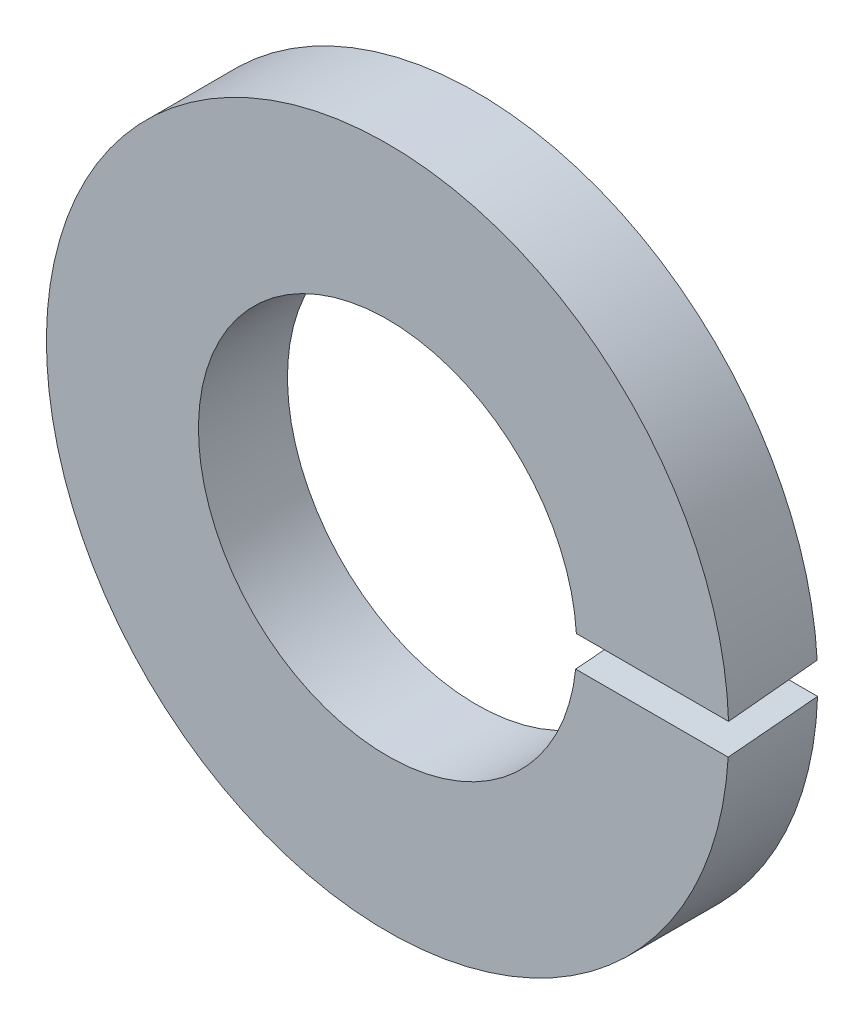
ISO-10303-21;
HEADER;
FILE_DESCRIPTION(('STEP AP214'),'2;1');
FILE_NAME('part.step','',(''),(''),'','','');
FILE_SCHEMA(('AUTOMOTIVE_DESIGN { 1 0 10303 214 1 1 1 1 }'));
ENDSEC;
DATA;
#1=APPLICATION_CONTEXT('core data for automotive mechanical design processes');
#2=APPLICATION_PROTOCOL_DEFINITION('international standard','automotive_design',2000,#1);
#3=PRODUCT_CONTEXT('',#1,'mechanical');
#4=PRODUCT('Part','Part','',(#3));
#5=PRODUCT_RELATED_PRODUCT_CATEGORY('part','',(#4));
#6=PRODUCT_DEFINITION_FORMATION('','',#4);
#7=PRODUCT_DEFINITION_CONTEXT('part definition',#1,'design');
#8=PRODUCT_DEFINITION('design','',#6,#7);
#9=PRODUCT_DEFINITION_SHAPE('','',#8);
#10=(LENGTH_UNIT() NAMED_UNIT(*) SI_UNIT(.MILLI.,.METRE.));
#11=(NAMED_UNIT(*) PLANE_ANGLE_UNIT() SI_UNIT($,.RADIAN.));
#12=(NAMED_UNIT(*) SI_UNIT($,.STERADIAN.) SOLID_ANGLE_UNIT());
#13=UNCERTAINTY_MEASURE_WITH_UNIT(LENGTH_MEASURE(1.E-05),#10,'distance_accuracy_value','');
#14=(GEOMETRIC_REPRESENTATION_CONTEXT(3) GLOBAL_UNCERTAINTY_ASSIGNED_CONTEXT((#13)) GLOBAL_UNIT_ASSIGNED_CONTEXT((#10,
#11,#12)) REPRESENTATION_CONTEXT('',''));
#15=CARTESIAN_POINT('',(0.,0.,0.));
#16=DIRECTION('',(0.,0.,1.));
#17=DIRECTION('',(1.,0.,0.));
#18=AXIS2_PLACEMENT_3D('',#15,#16,#17);
#19=CARTESIAN_POINT('',(-5.059871490933,5.06,-0.020000508811784));
#20=DIRECTION('',(0.,0.,1.));
#21=DIRECTION('',(0.,-1.,0.));
#22=AXIS2_PLACEMENT_3D('',#19,#20,#21);
#23=PLANE('',#22);
#24=CARTESIAN_POINT('',(0.,0.,-0.020000508811784));
#25=DIRECTION('',(0.,0.,-1.));
#26=DIRECTION('',(-1.,0.,0.));
#27=AXIS2_PLACEMENT_3D('',#24,#25,#26);
#28=CIRCLE('',#27,4.60000000000004);
#29=CARTESIAN_POINT('',(4.59228820279179,-0.26625,-0.020000508811783));
#30=VERTEX_POINT('',#29);
#31=CARTESIAN_POINT('',(4.59742981865964,0.15375,-0.0200005088117825));
#32=VERTEX_POINT('',#31);
#33=EDGE_CURVE('E68',#30,#32,#28,.T.);
#34=ORIENTED_EDGE('',*,*,#33,.F.);
#35=DIRECTION('',(1.,0.,0.));
#36=VECTOR('',#35,1.);
#37=CARTESIAN_POINT('',(3.56674595562755,-0.26625,-0.020000508811782));
#38=LINE('',#37,#36);
#39=CARTESIAN_POINT('',(2.53606209259559,-0.266250000000001,-0.0200005088117752));
#40=VERTEX_POINT('',#39);
#41=EDGE_CURVE('E63',#40,#30,#38,.T.);
#42=ORIENTED_EDGE('',*,*,#41,.F.);
#43=CARTESIAN_POINT('',(0.,0.,-0.0200005088117669));
#44=DIRECTION('',(0.,0.,1.));
#45=DIRECTION('',(0.,-1.,0.));
#46=AXIS2_PLACEMENT_3D('',#43,#44,#45);
#47=CIRCLE('',#46,2.55000000000005);
#48=CARTESIAN_POINT('',(2.54536066943372,0.15375,-0.0200005088117779));
#49=VERTEX_POINT('',#48);
#50=EDGE_CURVE('E67',#49,#40,#47,.T.);
#51=ORIENTED_EDGE('',*,*,#50,.F.);
#52=DIRECTION('',(-1.,0.,0.));
#53=VECTOR('',#52,1.);
#54=CARTESIAN_POINT('',(3.56674595562755,0.15375,-0.0200005088117811));
#55=LINE('',#54,#53);
#56=EDGE_CURVE('E78',#32,#49,#55,.T.);
#57=ORIENTED_EDGE('',*,*,#56,.F.);
#58=EDGE_LOOP('',(#34,#42,#51,#57));
#59=FACE_BOUND('',#58,.T.);
#60=ADVANCED_FACE('F17',(#59),#23,.T.);
#61=CARTESIAN_POINT('',(2.4329937062923,-0.148125,-1.2800005088118));
#62=DIRECTION('',(0.,0.995634226059288,0.0933407086930569));
#63=DIRECTION('',(0.,-0.0933407086930569,0.995634226059288));
#64=AXIS2_PLACEMENT_3D('',#61,#62,#63);
#65=PLANE('',#64);
#66=ORIENTED_EDGE('',*,*,#41,.T.);
#67=CARTESIAN_POINT('',(0.,0.,-2.86000050881192));
#68=DIRECTION('',(0.,0.995634226059288,0.0933407086930569));
#69=DIRECTION('',(0.,0.0933407086930569,-0.995634226059288));
#70=AXIS2_PLACEMENT_3D('',#67,#68,#69);
#71=ELLIPSE('',#70,49.2818199519648,4.60000000000003);
#72=CARTESIAN_POINT('',(4.59742981865962,-0.153749999999975,-1.2200005088118));
#73=VERTEX_POINT('',#72);
#74=EDGE_CURVE('E21',#73,#30,#71,.F.);
#75=ORIENTED_EDGE('',*,*,#74,.F.);
#76=DIRECTION('',(1.,0.,0.));
#77=VECTOR('',#76,1.);
#78=CARTESIAN_POINT('',(-0.0012850906702497,-0.15374999999995,-1.2200005088118));
#79=LINE('',#78,#77);
#80=CARTESIAN_POINT('',(2.54536066943376,-0.153749999999975,-1.2200005088118));
#81=VERTEX_POINT('',#80);
#82=EDGE_CURVE('E73',#81,#73,#79,.T.);
#83=ORIENTED_EDGE('',*,*,#82,.F.);
#84=CARTESIAN_POINT('',(0.,0.,-2.86000050881162));
#85=DIRECTION('',(0.,0.995634226059288,0.0933407086930569));
#86=DIRECTION('',(0.,-0.0933407086930569,0.995634226059288));
#87=AXIS2_PLACEMENT_3D('',#84,#85,#86);
#88=ELLIPSE('',#87,27.3192697559829,2.55000000000005);
#89=EDGE_CURVE('E71',#40,#81,#88,.T.);
#90=ORIENTED_EDGE('',*,*,#89,.F.);
#91=EDGE_LOOP('',(#66,#75,#83,#90));
#92=FACE_BOUND('',#91,.T.);
#93=ADVANCED_FACE('F72',(#92),#65,.T.);
#94=CARTESIAN_POINT('',(0.,0.,0.03999949118822));
#95=DIRECTION('',(0.,0.,-1.));
#96=DIRECTION('',(-1.,0.,0.));
#97=AXIS2_PLACEMENT_3D('',#94,#95,#96);
#98=CYLINDRICAL_SURFACE('',#97,4.60000000000004);
#99=CARTESIAN_POINT('',(0.,0.,1.61999949118776));
#100=DIRECTION('',(0.,-0.995634226059288,-0.0933407086930568));
#101=DIRECTION('',(0.,0.0933407086930568,-0.995634226059288));
#102=AXIS2_PLACEMENT_3D('',#99,#100,#101);
#103=ELLIPSE('',#102,49.281819951965,4.60000000000004);
#104=CARTESIAN_POINT('',(4.5922882027918,0.266249999999995,-1.2200005088118));
#105=VERTEX_POINT('',#104);
#106=EDGE_CURVE('E82',#105,#32,#103,.T.);
#107=ORIENTED_EDGE('',*,*,#106,.F.);
#108=CARTESIAN_POINT('',(0.,0.,-1.2200005088118));
#109=DIRECTION('',(0.,0.,-1.));
#110=DIRECTION('',(-1.,0.,0.));
#111=AXIS2_PLACEMENT_3D('',#108,#109,#110);
#112=CIRCLE('',#111,4.60000000000003);
#113=EDGE_CURVE('E87',#73,#105,#112,.T.);
#114=ORIENTED_EDGE('',*,*,#113,.F.);
#115=ORIENTED_EDGE('',*,*,#74,.T.);
#116=ORIENTED_EDGE('',*,*,#33,.T.);
#117=EDGE_LOOP('',(#107,#114,#115,#116));
#118=FACE_BOUND('',#117,.T.);
#119=ADVANCED_FACE('F86',(#118),#98,.T.);
#120=CARTESIAN_POINT('',(2.4329937062923,0.148125,0.03999949118822));
#121=DIRECTION('',(0.,-0.995634226059288,-0.0933407086930568));
#122=DIRECTION('',(0.,0.0933407086930568,-0.995634226059288));
#123=AXIS2_PLACEMENT_3D('',#120,#121,#122);
#124=PLANE('',#123);
#125=ORIENTED_EDGE('',*,*,#56,.T.);
#126=CARTESIAN_POINT('',(0.,0.,1.61999949118804));
#127=DIRECTION('',(0.,-0.995634226059288,-0.0933407086930568));
#128=DIRECTION('',(0.,-0.0933407086930568,0.995634226059288));
#129=AXIS2_PLACEMENT_3D('',#126,#127,#128);
#130=ELLIPSE('',#129,27.319269755979,2.55);
#131=CARTESIAN_POINT('',(2.53606209259553,0.266249999999995,-1.2200005088118));
#132=VERTEX_POINT('',#131);
#133=EDGE_CURVE('E36',#132,#49,#130,.T.);
#134=ORIENTED_EDGE('',*,*,#133,.F.);
#135=DIRECTION('',(-1.,0.,0.));
#136=VECTOR('',#135,1.);
#137=CARTESIAN_POINT('',(-0.0012850906702497,0.26624999999999,-1.2200005088118));
#138=LINE('',#137,#136);
#139=EDGE_CURVE('E27',#105,#132,#138,.T.);
#140=ORIENTED_EDGE('',*,*,#139,.F.);
#141=ORIENTED_EDGE('',*,*,#106,.T.);
#142=EDGE_LOOP('',(#125,#134,#140,#141));
#143=FACE_BOUND('',#142,.T.);
#144=ADVANCED_FACE('F91',(#143),#124,.T.);
#145=CARTESIAN_POINT('',(0.,0.,-1.28000050881181));
#146=DIRECTION('',(0.,0.,1.));
#147=DIRECTION('',(0.,-1.,0.));
#148=AXIS2_PLACEMENT_3D('',#145,#146,#147);
#149=CYLINDRICAL_SURFACE('',#148,2.55000000000005);
#150=ORIENTED_EDGE('',*,*,#89,.T.);
#151=CARTESIAN_POINT('',(0.,0.,-1.2200005088118));
#152=DIRECTION('',(0.,0.,-1.));
#153=DIRECTION('',(-1.,0.,0.));
#154=AXIS2_PLACEMENT_3D('',#151,#152,#153);
#155=CIRCLE('',#154,2.55);
#156=EDGE_CURVE('E11',#132,#81,#155,.F.);
#157=ORIENTED_EDGE('',*,*,#156,.F.);
#158=ORIENTED_EDGE('',*,*,#133,.T.);
#159=ORIENTED_EDGE('',*,*,#50,.T.);
#160=EDGE_LOOP('',(#150,#157,#158,#159));
#161=FACE_BOUND('',#160,.T.);
#162=ADVANCED_FACE('F76',(#161),#149,.F.);
#163=CARTESIAN_POINT('',(-5.059871490933,-5.06,-1.2200005088118));
#164=DIRECTION('',(0.,0.,-1.));
#165=DIRECTION('',(0.,1.,0.));
#166=AXIS2_PLACEMENT_3D('',#163,#164,#165);
#167=PLANE('',#166);
#168=ORIENTED_EDGE('',*,*,#156,.T.);
#169=ORIENTED_EDGE('',*,*,#82,.T.);
#170=ORIENTED_EDGE('',*,*,#113,.T.);
#171=ORIENTED_EDGE('',*,*,#139,.T.);
#172=EDGE_LOOP('',(#168,#169,#170,#171));
#173=FACE_BOUND('',#172,.T.);
#174=ADVANCED_FACE('F19',(#173),#167,.T.);
#175=CLOSED_SHELL('',(#60,#93,#119,#144,#162,#174));
#176=MANIFOLD_SOLID_BREP('B1',#175);
#177=ADVANCED_BREP_SHAPE_REPRESENTATION('',(#18,#176),#14);
#178=SHAPE_DEFINITION_REPRESENTATION(#9,#177);
ENDSEC;
END-ISO-10303-21;
